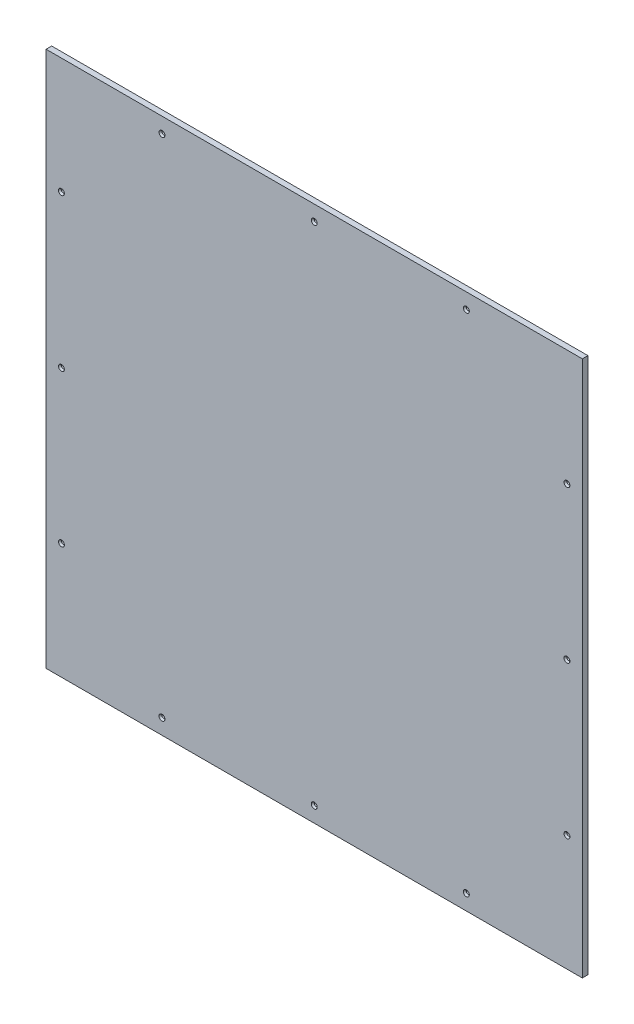
ISO-10303-21;
HEADER;
FILE_DESCRIPTION(('STEP AP214'),'2;1');
FILE_NAME('part.step','',(''),(''),'','','');
FILE_SCHEMA(('AUTOMOTIVE_DESIGN { 1 0 10303 214 1 1 1 1 }'));
ENDSEC;
DATA;
#1=APPLICATION_CONTEXT('core data for automotive mechanical design processes');
#2=APPLICATION_PROTOCOL_DEFINITION('international standard','automotive_design',2000,#1);
#3=PRODUCT_CONTEXT('',#1,'mechanical');
#4=PRODUCT('Part','Part','',(#3));
#5=PRODUCT_RELATED_PRODUCT_CATEGORY('part','',(#4));
#6=PRODUCT_DEFINITION_FORMATION('','',#4);
#7=PRODUCT_DEFINITION_CONTEXT('part definition',#1,'design');
#8=PRODUCT_DEFINITION('design','',#6,#7);
#9=PRODUCT_DEFINITION_SHAPE('','',#8);
#10=(LENGTH_UNIT() NAMED_UNIT(*) SI_UNIT(.MILLI.,.METRE.));
#11=(NAMED_UNIT(*) PLANE_ANGLE_UNIT() SI_UNIT($,.RADIAN.));
#12=(NAMED_UNIT(*) SI_UNIT($,.STERADIAN.) SOLID_ANGLE_UNIT());
#13=UNCERTAINTY_MEASURE_WITH_UNIT(LENGTH_MEASURE(1.E-05),#10,'distance_accuracy_value','');
#14=(GEOMETRIC_REPRESENTATION_CONTEXT(3) GLOBAL_UNCERTAINTY_ASSIGNED_CONTEXT((#13)) GLOBAL_UNIT_ASSIGNED_CONTEXT((#10,
#11,#12)) REPRESENTATION_CONTEXT('',''));
#15=CARTESIAN_POINT('',(0.,0.,0.));
#16=DIRECTION('',(0.,0.,1.));
#17=DIRECTION('',(1.,0.,0.));
#18=AXIS2_PLACEMENT_3D('',#15,#16,#17);
#19=CARTESIAN_POINT('',(-609.6,0.,12.7));
#20=DIRECTION('',(-1.,0.,0.));
#21=DIRECTION('',(0.,0.,1.));
#22=AXIS2_PLACEMENT_3D('',#19,#20,#21);
#23=PLANE('',#22);
#24=DIRECTION('',(0.,1.,0.));
#25=VECTOR('',#24,1.);
#26=CARTESIAN_POINT('',(-609.6,0.,0.));
#27=LINE('',#26,#25);
#28=CARTESIAN_POINT('',(-609.6,-25.4000000000001,0.));
#29=VERTEX_POINT('',#28);
#30=CARTESIAN_POINT('',(-609.6,1193.8,0.));
#31=VERTEX_POINT('',#30);
#32=EDGE_CURVE('E134',#29,#31,#27,.T.);
#33=ORIENTED_EDGE('',*,*,#32,.F.);
#34=DIRECTION('',(0.,0.,-1.));
#35=VECTOR('',#34,1.);
#36=CARTESIAN_POINT('',(-609.6,-25.4000000000001,12.7));
#37=LINE('',#36,#35);
#38=CARTESIAN_POINT('',(-609.6,-25.4000000000001,12.7));
#39=VERTEX_POINT('',#38);
#40=EDGE_CURVE('E81',#39,#29,#37,.T.);
#41=ORIENTED_EDGE('',*,*,#40,.F.);
#42=DIRECTION('',(0.,1.,0.));
#43=VECTOR('',#42,1.);
#44=CARTESIAN_POINT('',(-609.6,0.,12.7));
#45=LINE('',#44,#43);
#46=CARTESIAN_POINT('',(-609.6,1193.8,12.7));
#47=VERTEX_POINT('',#46);
#48=EDGE_CURVE('E123',#39,#47,#45,.T.);
#49=ORIENTED_EDGE('',*,*,#48,.T.);
#50=DIRECTION('',(0.,0.,-1.));
#51=VECTOR('',#50,1.);
#52=CARTESIAN_POINT('',(-609.6,1193.8,12.7));
#53=LINE('',#52,#51);
#54=EDGE_CURVE('E95',#47,#31,#53,.T.);
#55=ORIENTED_EDGE('',*,*,#54,.T.);
#56=EDGE_LOOP('',(#33,#41,#49,#55));
#57=FACE_BOUND('',#56,.T.);
#58=ADVANCED_FACE('F64',(#57),#23,.T.);
#59=CARTESIAN_POINT('',(0.,0.,0.));
#60=DIRECTION('',(0.,0.,1.));
#61=DIRECTION('',(1.,0.,0.));
#62=AXIS2_PLACEMENT_3D('',#59,#60,#61);
#63=PLANE('',#62);
#64=CARTESIAN_POINT('',(345.948,9.52500000000001,0.));
#65=DIRECTION('',(0.,0.,1.));
#66=DIRECTION('',(1.,0.,0.));
#67=AXIS2_PLACEMENT_3D('',#64,#65,#66);
#68=CIRCLE('',#67,3.57123999999998);
#69=CARTESIAN_POINT('',(349.51924,9.52500000000001,0.));
#70=VERTEX_POINT('',#69);
#71=EDGE_CURVE('E238',#70,#70,#68,.T.);
#72=ORIENTED_EDGE('',*,*,#71,.T.);
#73=EDGE_LOOP('',(#72));
#74=FACE_BOUND('',#73,.T.);
#75=CARTESIAN_POINT('',(0.127000000000099,9.52500000000001,0.));
#76=DIRECTION('',(0.,0.,1.));
#77=DIRECTION('',(1.,0.,0.));
#78=AXIS2_PLACEMENT_3D('',#75,#76,#77);
#79=CIRCLE('',#78,3.57124);
#80=CARTESIAN_POINT('',(3.6982400000001,9.52500000000001,0.));
#81=VERTEX_POINT('',#80);
#82=EDGE_CURVE('E229',#81,#81,#79,.T.);
#83=ORIENTED_EDGE('',*,*,#82,.T.);
#84=EDGE_LOOP('',(#83));
#85=FACE_BOUND('',#84,.T.);
#86=CARTESIAN_POINT('',(-346.075,9.52500000000001,0.));
#87=DIRECTION('',(0.,0.,1.));
#88=DIRECTION('',(1.,0.,0.));
#89=AXIS2_PLACEMENT_3D('',#86,#87,#88);
#90=CIRCLE('',#89,3.57123999999998);
#91=CARTESIAN_POINT('',(-342.50376,9.52500000000001,0.));
#92=VERTEX_POINT('',#91);
#93=EDGE_CURVE('E220',#92,#92,#90,.T.);
#94=ORIENTED_EDGE('',*,*,#93,.T.);
#95=EDGE_LOOP('',(#94));
#96=FACE_BOUND('',#95,.T.);
#97=CARTESIAN_POINT('',(-574.675,238.252,0.));
#98=DIRECTION('',(0.,0.,1.));
#99=DIRECTION('',(1.,0.,0.));
#100=AXIS2_PLACEMENT_3D('',#97,#98,#99);
#101=CIRCLE('',#100,3.57123999999998);
#102=CARTESIAN_POINT('',(-571.10376,238.252,0.));
#103=VERTEX_POINT('',#102);
#104=EDGE_CURVE('E211',#103,#103,#101,.T.);
#105=ORIENTED_EDGE('',*,*,#104,.T.);
#106=EDGE_LOOP('',(#105));
#107=FACE_BOUND('',#106,.T.);
#108=CARTESIAN_POINT('',(-574.675,583.946,0.));
#109=DIRECTION('',(0.,0.,1.));
#110=DIRECTION('',(1.,0.,0.));
#111=AXIS2_PLACEMENT_3D('',#108,#109,#110);
#112=CIRCLE('',#111,3.57123999999998);
#113=CARTESIAN_POINT('',(-571.10376,583.946,0.));
#114=VERTEX_POINT('',#113);
#115=EDGE_CURVE('E202',#114,#114,#112,.T.);
#116=ORIENTED_EDGE('',*,*,#115,.T.);
#117=EDGE_LOOP('',(#116));
#118=FACE_BOUND('',#117,.T.);
#119=CARTESIAN_POINT('',(-574.675,930.148,0.));
#120=DIRECTION('',(0.,0.,1.));
#121=DIRECTION('',(1.,0.,0.));
#122=AXIS2_PLACEMENT_3D('',#119,#120,#121);
#123=CIRCLE('',#122,3.57123999999998);
#124=CARTESIAN_POINT('',(-571.10376,930.148,0.));
#125=VERTEX_POINT('',#124);
#126=EDGE_CURVE('E193',#125,#125,#123,.T.);
#127=ORIENTED_EDGE('',*,*,#126,.T.);
#128=EDGE_LOOP('',(#127));
#129=FACE_BOUND('',#128,.T.);
#130=CARTESIAN_POINT('',(-346.075,1158.875,0.));
#131=DIRECTION('',(0.,0.,1.));
#132=DIRECTION('',(1.,0.,0.));
#133=AXIS2_PLACEMENT_3D('',#130,#131,#132);
#134=CIRCLE('',#133,3.57123999999998);
#135=CARTESIAN_POINT('',(-342.50376,1158.875,0.));
#136=VERTEX_POINT('',#135);
#137=EDGE_CURVE('E184',#136,#136,#134,.T.);
#138=ORIENTED_EDGE('',*,*,#137,.T.);
#139=EDGE_LOOP('',(#138));
#140=FACE_BOUND('',#139,.T.);
#141=CARTESIAN_POINT('',(0.127000000000099,1158.875,0.));
#142=DIRECTION('',(0.,0.,1.));
#143=DIRECTION('',(1.,0.,0.));
#144=AXIS2_PLACEMENT_3D('',#141,#142,#143);
#145=CIRCLE('',#144,3.57124);
#146=CARTESIAN_POINT('',(3.6982400000001,1158.875,0.));
#147=VERTEX_POINT('',#146);
#148=EDGE_CURVE('E175',#147,#147,#145,.T.);
#149=ORIENTED_EDGE('',*,*,#148,.T.);
#150=EDGE_LOOP('',(#149));
#151=FACE_BOUND('',#150,.T.);
#152=CARTESIAN_POINT('',(345.948,1158.875,0.));
#153=DIRECTION('',(0.,0.,1.));
#154=DIRECTION('',(1.,0.,0.));
#155=AXIS2_PLACEMENT_3D('',#152,#153,#154);
#156=CIRCLE('',#155,3.57123999999998);
#157=CARTESIAN_POINT('',(349.51924,1158.875,0.));
#158=VERTEX_POINT('',#157);
#159=EDGE_CURVE('E166',#158,#158,#156,.T.);
#160=ORIENTED_EDGE('',*,*,#159,.T.);
#161=EDGE_LOOP('',(#160));
#162=FACE_BOUND('',#161,.T.);
#163=CARTESIAN_POINT('',(574.675,930.148,0.));
#164=DIRECTION('',(0.,0.,1.));
#165=DIRECTION('',(1.,0.,0.));
#166=AXIS2_PLACEMENT_3D('',#163,#164,#165);
#167=CIRCLE('',#166,3.57123999999998);
#168=CARTESIAN_POINT('',(578.24624,930.148,0.));
#169=VERTEX_POINT('',#168);
#170=EDGE_CURVE('E157',#169,#169,#167,.T.);
#171=ORIENTED_EDGE('',*,*,#170,.T.);
#172=EDGE_LOOP('',(#171));
#173=FACE_BOUND('',#172,.T.);
#174=CARTESIAN_POINT('',(574.675,583.946,0.));
#175=DIRECTION('',(0.,0.,1.));
#176=DIRECTION('',(1.,0.,0.));
#177=AXIS2_PLACEMENT_3D('',#174,#175,#176);
#178=CIRCLE('',#177,3.57123999999998);
#179=CARTESIAN_POINT('',(578.24624,583.946,0.));
#180=VERTEX_POINT('',#179);
#181=EDGE_CURVE('E148',#180,#180,#178,.T.);
#182=ORIENTED_EDGE('',*,*,#181,.T.);
#183=EDGE_LOOP('',(#182));
#184=FACE_BOUND('',#183,.T.);
#185=CARTESIAN_POINT('',(574.675,238.252,0.));
#186=DIRECTION('',(0.,0.,1.));
#187=DIRECTION('',(1.,0.,0.));
#188=AXIS2_PLACEMENT_3D('',#185,#186,#187);
#189=CIRCLE('',#188,3.57123999999998);
#190=CARTESIAN_POINT('',(578.24624,238.252,0.));
#191=VERTEX_POINT('',#190);
#192=EDGE_CURVE('E130',#191,#191,#189,.T.);
#193=ORIENTED_EDGE('',*,*,#192,.T.);
#194=EDGE_LOOP('',(#193));
#195=FACE_BOUND('',#194,.T.);
#196=DIRECTION('',(1.,0.,0.));
#197=VECTOR('',#196,1.);
#198=CARTESIAN_POINT('',(0.,-25.4000000000001,0.));
#199=LINE('',#198,#197);
#200=CARTESIAN_POINT('',(609.6,-25.4000000000001,0.));
#201=VERTEX_POINT('',#200);
#202=EDGE_CURVE('E128',#29,#201,#199,.T.);
#203=ORIENTED_EDGE('',*,*,#202,.F.);
#204=ORIENTED_EDGE('',*,*,#32,.T.);
#205=DIRECTION('',(1.,0.,0.));
#206=VECTOR('',#205,1.);
#207=CARTESIAN_POINT('',(0.,1193.8,0.));
#208=LINE('',#207,#206);
#209=CARTESIAN_POINT('',(609.6,1193.8,0.));
#210=VERTEX_POINT('',#209);
#211=EDGE_CURVE('E132',#31,#210,#208,.T.);
#212=ORIENTED_EDGE('',*,*,#211,.T.);
#213=DIRECTION('',(0.,1.,0.));
#214=VECTOR('',#213,1.);
#215=CARTESIAN_POINT('',(609.6,0.,0.));
#216=LINE('',#215,#214);
#217=EDGE_CURVE('E119',#201,#210,#216,.T.);
#218=ORIENTED_EDGE('',*,*,#217,.F.);
#219=EDGE_LOOP('',(#203,#204,#212,#218));
#220=FACE_BOUND('',#219,.T.);
#221=ADVANCED_FACE('F291',(#74,#85,#96,#107,#118,#129,#140,#151,#162,#173,#184,#195,#220),#63,.F.);
#222=CARTESIAN_POINT('',(0.,1193.8,12.7));
#223=DIRECTION('',(0.,1.,0.));
#224=DIRECTION('',(0.,0.,1.));
#225=AXIS2_PLACEMENT_3D('',#222,#223,#224);
#226=PLANE('',#225);
#227=ORIENTED_EDGE('',*,*,#211,.F.);
#228=ORIENTED_EDGE('',*,*,#54,.F.);
#229=DIRECTION('',(1.,0.,0.));
#230=VECTOR('',#229,1.);
#231=CARTESIAN_POINT('',(0.,1193.8,12.7));
#232=LINE('',#231,#230);
#233=CARTESIAN_POINT('',(609.6,1193.8,12.7));
#234=VERTEX_POINT('',#233);
#235=EDGE_CURVE('E113',#47,#234,#232,.T.);
#236=ORIENTED_EDGE('',*,*,#235,.T.);
#237=DIRECTION('',(0.,0.,-1.));
#238=VECTOR('',#237,1.);
#239=CARTESIAN_POINT('',(609.6,1193.8,12.7));
#240=LINE('',#239,#238);
#241=EDGE_CURVE('E73',#234,#210,#240,.T.);
#242=ORIENTED_EDGE('',*,*,#241,.T.);
#243=EDGE_LOOP('',(#227,#228,#236,#242));
#244=FACE_BOUND('',#243,.T.);
#245=ADVANCED_FACE('F122',(#244),#226,.T.);
#246=CARTESIAN_POINT('',(609.6,0.,12.7));
#247=DIRECTION('',(-1.,0.,0.));
#248=DIRECTION('',(0.,0.,1.));
#249=AXIS2_PLACEMENT_3D('',#246,#247,#248);
#250=PLANE('',#249);
#251=ORIENTED_EDGE('',*,*,#217,.T.);
#252=ORIENTED_EDGE('',*,*,#241,.F.);
#253=DIRECTION('',(0.,1.,0.));
#254=VECTOR('',#253,1.);
#255=CARTESIAN_POINT('',(609.6,0.,12.7));
#256=LINE('',#255,#254);
#257=CARTESIAN_POINT('',(609.6,-25.4000000000001,12.7));
#258=VERTEX_POINT('',#257);
#259=EDGE_CURVE('E106',#258,#234,#256,.T.);
#260=ORIENTED_EDGE('',*,*,#259,.F.);
#261=DIRECTION('',(0.,0.,-1.));
#262=VECTOR('',#261,1.);
#263=CARTESIAN_POINT('',(609.6,-25.4000000000001,12.7));
#264=LINE('',#263,#262);
#265=EDGE_CURVE('E12',#258,#201,#264,.T.);
#266=ORIENTED_EDGE('',*,*,#265,.T.);
#267=EDGE_LOOP('',(#251,#252,#260,#266));
#268=FACE_BOUND('',#267,.T.);
#269=ADVANCED_FACE('F118',(#268),#250,.F.);
#270=CARTESIAN_POINT('',(0.,-25.4000000000001,12.7));
#271=DIRECTION('',(0.,1.,0.));
#272=DIRECTION('',(0.,0.,1.));
#273=AXIS2_PLACEMENT_3D('',#270,#271,#272);
#274=PLANE('',#273);
#275=ORIENTED_EDGE('',*,*,#202,.T.);
#276=ORIENTED_EDGE('',*,*,#265,.F.);
#277=DIRECTION('',(1.,0.,0.));
#278=VECTOR('',#277,1.);
#279=CARTESIAN_POINT('',(0.,-25.4000000000001,12.7));
#280=LINE('',#279,#278);
#281=EDGE_CURVE('E114',#39,#258,#280,.T.);
#282=ORIENTED_EDGE('',*,*,#281,.F.);
#283=ORIENTED_EDGE('',*,*,#40,.T.);
#284=EDGE_LOOP('',(#275,#276,#282,#283));
#285=FACE_BOUND('',#284,.T.);
#286=ADVANCED_FACE('F66',(#285),#274,.F.);
#287=CARTESIAN_POINT('',(0.,0.,12.7));
#288=DIRECTION('',(0.,0.,1.));
#289=DIRECTION('',(1.,0.,0.));
#290=AXIS2_PLACEMENT_3D('',#287,#288,#289);
#291=PLANE('',#290);
#292=CARTESIAN_POINT('',(345.948,9.52500000000001,12.7));
#293=DIRECTION('',(0.,0.,1.));
#294=DIRECTION('',(1.,0.,0.));
#295=AXIS2_PLACEMENT_3D('',#292,#293,#294);
#296=CIRCLE('',#295,6.74370000000002);
#297=CARTESIAN_POINT('',(352.6917,9.52500000000001,12.7));
#298=VERTEX_POINT('',#297);
#299=EDGE_CURVE('E244',#298,#298,#296,.T.);
#300=ORIENTED_EDGE('',*,*,#299,.F.);
#301=EDGE_LOOP('',(#300));
#302=FACE_BOUND('',#301,.T.);
#303=CARTESIAN_POINT('',(0.127000000000099,9.52500000000001,12.7));
#304=DIRECTION('',(0.,0.,1.));
#305=DIRECTION('',(1.,0.,0.));
#306=AXIS2_PLACEMENT_3D('',#303,#304,#305);
#307=CIRCLE('',#306,6.7437);
#308=CARTESIAN_POINT('',(6.8707000000001,9.52500000000001,12.7));
#309=VERTEX_POINT('',#308);
#310=EDGE_CURVE('E235',#309,#309,#307,.T.);
#311=ORIENTED_EDGE('',*,*,#310,.F.);
#312=EDGE_LOOP('',(#311));
#313=FACE_BOUND('',#312,.T.);
#314=CARTESIAN_POINT('',(-346.075,9.52500000000001,12.7));
#315=DIRECTION('',(0.,0.,1.));
#316=DIRECTION('',(1.,0.,0.));
#317=AXIS2_PLACEMENT_3D('',#314,#315,#316);
#318=CIRCLE('',#317,6.74370000000002);
#319=CARTESIAN_POINT('',(-339.3313,9.52500000000001,12.7));
#320=VERTEX_POINT('',#319);
#321=EDGE_CURVE('E226',#320,#320,#318,.T.);
#322=ORIENTED_EDGE('',*,*,#321,.F.);
#323=EDGE_LOOP('',(#322));
#324=FACE_BOUND('',#323,.T.);
#325=CARTESIAN_POINT('',(-574.675,238.252,12.7));
#326=DIRECTION('',(0.,0.,1.));
#327=DIRECTION('',(1.,0.,0.));
#328=AXIS2_PLACEMENT_3D('',#325,#326,#327);
#329=CIRCLE('',#328,6.74370000000002);
#330=CARTESIAN_POINT('',(-567.9313,238.252,12.7));
#331=VERTEX_POINT('',#330);
#332=EDGE_CURVE('E217',#331,#331,#329,.T.);
#333=ORIENTED_EDGE('',*,*,#332,.F.);
#334=EDGE_LOOP('',(#333));
#335=FACE_BOUND('',#334,.T.);
#336=CARTESIAN_POINT('',(-574.675,583.946,12.7));
#337=DIRECTION('',(0.,0.,1.));
#338=DIRECTION('',(1.,0.,0.));
#339=AXIS2_PLACEMENT_3D('',#336,#337,#338);
#340=CIRCLE('',#339,6.74370000000002);
#341=CARTESIAN_POINT('',(-567.9313,583.946,12.7));
#342=VERTEX_POINT('',#341);
#343=EDGE_CURVE('E208',#342,#342,#340,.T.);
#344=ORIENTED_EDGE('',*,*,#343,.F.);
#345=EDGE_LOOP('',(#344));
#346=FACE_BOUND('',#345,.T.);
#347=CARTESIAN_POINT('',(-574.675,930.148,12.7));
#348=DIRECTION('',(0.,0.,1.));
#349=DIRECTION('',(1.,0.,0.));
#350=AXIS2_PLACEMENT_3D('',#347,#348,#349);
#351=CIRCLE('',#350,6.74370000000002);
#352=CARTESIAN_POINT('',(-567.9313,930.148,12.7));
#353=VERTEX_POINT('',#352);
#354=EDGE_CURVE('E199',#353,#353,#351,.T.);
#355=ORIENTED_EDGE('',*,*,#354,.F.);
#356=EDGE_LOOP('',(#355));
#357=FACE_BOUND('',#356,.T.);
#358=CARTESIAN_POINT('',(-346.075,1158.875,12.7));
#359=DIRECTION('',(0.,0.,1.));
#360=DIRECTION('',(1.,0.,0.));
#361=AXIS2_PLACEMENT_3D('',#358,#359,#360);
#362=CIRCLE('',#361,6.74370000000002);
#363=CARTESIAN_POINT('',(-339.3313,1158.875,12.7));
#364=VERTEX_POINT('',#363);
#365=EDGE_CURVE('E190',#364,#364,#362,.T.);
#366=ORIENTED_EDGE('',*,*,#365,.F.);
#367=EDGE_LOOP('',(#366));
#368=FACE_BOUND('',#367,.T.);
#369=CARTESIAN_POINT('',(0.127000000000099,1158.875,12.7));
#370=DIRECTION('',(0.,0.,1.));
#371=DIRECTION('',(1.,0.,0.));
#372=AXIS2_PLACEMENT_3D('',#369,#370,#371);
#373=CIRCLE('',#372,6.7437);
#374=CARTESIAN_POINT('',(6.8707000000001,1158.875,12.7));
#375=VERTEX_POINT('',#374);
#376=EDGE_CURVE('E181',#375,#375,#373,.T.);
#377=ORIENTED_EDGE('',*,*,#376,.F.);
#378=EDGE_LOOP('',(#377));
#379=FACE_BOUND('',#378,.T.);
#380=CARTESIAN_POINT('',(345.948,1158.875,12.7));
#381=DIRECTION('',(0.,0.,1.));
#382=DIRECTION('',(1.,0.,0.));
#383=AXIS2_PLACEMENT_3D('',#380,#381,#382);
#384=CIRCLE('',#383,6.74370000000002);
#385=CARTESIAN_POINT('',(352.6917,1158.875,12.7));
#386=VERTEX_POINT('',#385);
#387=EDGE_CURVE('E172',#386,#386,#384,.T.);
#388=ORIENTED_EDGE('',*,*,#387,.F.);
#389=EDGE_LOOP('',(#388));
#390=FACE_BOUND('',#389,.T.);
#391=CARTESIAN_POINT('',(574.675,930.148,12.7));
#392=DIRECTION('',(0.,0.,1.));
#393=DIRECTION('',(1.,0.,0.));
#394=AXIS2_PLACEMENT_3D('',#391,#392,#393);
#395=CIRCLE('',#394,6.74370000000002);
#396=CARTESIAN_POINT('',(581.4187,930.148,12.7));
#397=VERTEX_POINT('',#396);
#398=EDGE_CURVE('E163',#397,#397,#395,.T.);
#399=ORIENTED_EDGE('',*,*,#398,.F.);
#400=EDGE_LOOP('',(#399));
#401=FACE_BOUND('',#400,.T.);
#402=CARTESIAN_POINT('',(574.675,583.946,12.7));
#403=DIRECTION('',(0.,0.,1.));
#404=DIRECTION('',(1.,0.,0.));
#405=AXIS2_PLACEMENT_3D('',#402,#403,#404);
#406=CIRCLE('',#405,6.74370000000002);
#407=CARTESIAN_POINT('',(581.4187,583.946,12.7));
#408=VERTEX_POINT('',#407);
#409=EDGE_CURVE('E154',#408,#408,#406,.T.);
#410=ORIENTED_EDGE('',*,*,#409,.F.);
#411=EDGE_LOOP('',(#410));
#412=FACE_BOUND('',#411,.T.);
#413=CARTESIAN_POINT('',(574.675,238.252,12.7));
#414=DIRECTION('',(0.,0.,1.));
#415=DIRECTION('',(1.,0.,0.));
#416=AXIS2_PLACEMENT_3D('',#413,#414,#415);
#417=CIRCLE('',#416,6.74370000000002);
#418=CARTESIAN_POINT('',(581.4187,238.252,12.7));
#419=VERTEX_POINT('',#418);
#420=EDGE_CURVE('E145',#419,#419,#417,.T.);
#421=ORIENTED_EDGE('',*,*,#420,.F.);
#422=EDGE_LOOP('',(#421));
#423=FACE_BOUND('',#422,.T.);
#424=ORIENTED_EDGE('',*,*,#281,.T.);
#425=ORIENTED_EDGE('',*,*,#259,.T.);
#426=ORIENTED_EDGE('',*,*,#235,.F.);
#427=ORIENTED_EDGE('',*,*,#48,.F.);
#428=EDGE_LOOP('',(#424,#425,#426,#427));
#429=FACE_BOUND('',#428,.T.);
#430=ADVANCED_FACE('F110',(#302,#313,#324,#335,#346,#357,#368,#379,#390,#401,#412,#423,#429),
#291,.T.);
#431=CARTESIAN_POINT('',(574.675,238.252,12.7));
#432=DIRECTION('',(0.,0.,1.));
#433=DIRECTION('',(1.,0.,0.));
#434=AXIS2_PLACEMENT_3D('',#431,#432,#433);
#435=CYLINDRICAL_SURFACE('',#434,3.57123999999998);
#436=ORIENTED_EDGE('',*,*,#192,.F.);
#437=EDGE_LOOP('',(#436));
#438=FACE_BOUND('',#437,.T.);
#439=CARTESIAN_POINT('',(574.675,238.252,9.05050224282764));
#440=DIRECTION('',(0.,0.,1.));
#441=DIRECTION('',(1.,0.,0.));
#442=AXIS2_PLACEMENT_3D('',#439,#440,#441);
#443=CIRCLE('',#442,3.57123999999998);
#444=CARTESIAN_POINT('',(578.24624,238.252,9.05050224282764));
#445=VERTEX_POINT('',#444);
#446=EDGE_CURVE('E142',#445,#445,#443,.T.);
#447=ORIENTED_EDGE('',*,*,#446,.T.);
#448=EDGE_LOOP('',(#447));
#449=FACE_BOUND('',#448,.T.);
#450=ADVANCED_FACE('F252',(#438,#449),#435,.F.);
#451=CARTESIAN_POINT('',(574.675,238.252,12.7));
#452=DIRECTION('',(0.,0.,1.));
#453=DIRECTION('',(1.,0.,0.));
#454=AXIS2_PLACEMENT_3D('',#451,#452,#453);
#455=CONICAL_SURFACE('',#454,6.74370000000002,0.715584993317682);
#456=ORIENTED_EDGE('',*,*,#446,.F.);
#457=EDGE_LOOP('',(#456));
#458=FACE_BOUND('',#457,.T.);
#459=ORIENTED_EDGE('',*,*,#420,.T.);
#460=EDGE_LOOP('',(#459));
#461=FACE_BOUND('',#460,.T.);
#462=ADVANCED_FACE('F276',(#458,#461),#455,.F.);
#463=CARTESIAN_POINT('',(574.675,583.946,12.7));
#464=DIRECTION('',(0.,0.,1.));
#465=DIRECTION('',(1.,0.,0.));
#466=AXIS2_PLACEMENT_3D('',#463,#464,#465);
#467=CYLINDRICAL_SURFACE('',#466,3.57123999999998);
#468=ORIENTED_EDGE('',*,*,#181,.F.);
#469=EDGE_LOOP('',(#468));
#470=FACE_BOUND('',#469,.T.);
#471=CARTESIAN_POINT('',(574.675,583.946,9.05050224282764));
#472=DIRECTION('',(0.,0.,1.));
#473=DIRECTION('',(1.,0.,0.));
#474=AXIS2_PLACEMENT_3D('',#471,#472,#473);
#475=CIRCLE('',#474,3.57123999999998);
#476=CARTESIAN_POINT('',(578.24624,583.946,9.05050224282764));
#477=VERTEX_POINT('',#476);
#478=EDGE_CURVE('E151',#477,#477,#475,.T.);
#479=ORIENTED_EDGE('',*,*,#478,.T.);
#480=EDGE_LOOP('',(#479));
#481=FACE_BOUND('',#480,.T.);
#482=ADVANCED_FACE('F278',(#470,#481),#467,.F.);
#483=CARTESIAN_POINT('',(574.675,583.946,12.7));
#484=DIRECTION('',(0.,0.,1.));
#485=DIRECTION('',(1.,0.,0.));
#486=AXIS2_PLACEMENT_3D('',#483,#484,#485);
#487=CONICAL_SURFACE('',#486,6.74370000000002,0.715584993317682);
#488=ORIENTED_EDGE('',*,*,#478,.F.);
#489=EDGE_LOOP('',(#488));
#490=FACE_BOUND('',#489,.T.);
#491=ORIENTED_EDGE('',*,*,#409,.T.);
#492=EDGE_LOOP('',(#491));
#493=FACE_BOUND('',#492,.T.);
#494=ADVANCED_FACE('F285',(#490,#493),#487,.F.);
#495=CARTESIAN_POINT('',(574.675,930.148,12.7));
#496=DIRECTION('',(0.,0.,1.));
#497=DIRECTION('',(1.,0.,0.));
#498=AXIS2_PLACEMENT_3D('',#495,#496,#497);
#499=CYLINDRICAL_SURFACE('',#498,3.57123999999998);
#500=ORIENTED_EDGE('',*,*,#170,.F.);
#501=EDGE_LOOP('',(#500));
#502=FACE_BOUND('',#501,.T.);
#503=CARTESIAN_POINT('',(574.675,930.148,9.05050224282764));
#504=DIRECTION('',(0.,0.,1.));
#505=DIRECTION('',(1.,0.,0.));
#506=AXIS2_PLACEMENT_3D('',#503,#504,#505);
#507=CIRCLE('',#506,3.57123999999998);
#508=CARTESIAN_POINT('',(578.24624,930.148,9.05050224282764));
#509=VERTEX_POINT('',#508);
#510=EDGE_CURVE('E160',#509,#509,#507,.T.);
#511=ORIENTED_EDGE('',*,*,#510,.T.);
#512=EDGE_LOOP('',(#511));
#513=FACE_BOUND('',#512,.T.);
#514=ADVANCED_FACE('F338',(#502,#513),#499,.F.);
#515=CARTESIAN_POINT('',(574.675,930.148,12.7));
#516=DIRECTION('',(0.,0.,1.));
#517=DIRECTION('',(1.,0.,0.));
#518=AXIS2_PLACEMENT_3D('',#515,#516,#517);
#519=CONICAL_SURFACE('',#518,6.74370000000002,0.715584993317682);
#520=ORIENTED_EDGE('',*,*,#510,.F.);
#521=EDGE_LOOP('',(#520));
#522=FACE_BOUND('',#521,.T.);
#523=ORIENTED_EDGE('',*,*,#398,.T.);
#524=EDGE_LOOP('',(#523));
#525=FACE_BOUND('',#524,.T.);
#526=ADVANCED_FACE('F348',(#522,#525),#519,.F.);
#527=CARTESIAN_POINT('',(345.948,1158.875,12.7));
#528=DIRECTION('',(0.,0.,1.));
#529=DIRECTION('',(1.,0.,0.));
#530=AXIS2_PLACEMENT_3D('',#527,#528,#529);
#531=CYLINDRICAL_SURFACE('',#530,3.57123999999998);
#532=ORIENTED_EDGE('',*,*,#159,.F.);
#533=EDGE_LOOP('',(#532));
#534=FACE_BOUND('',#533,.T.);
#535=CARTESIAN_POINT('',(345.948,1158.875,9.05050224282764));
#536=DIRECTION('',(0.,0.,1.));
#537=DIRECTION('',(1.,0.,0.));
#538=AXIS2_PLACEMENT_3D('',#535,#536,#537);
#539=CIRCLE('',#538,3.57123999999998);
#540=CARTESIAN_POINT('',(349.51924,1158.875,9.05050224282764));
#541=VERTEX_POINT('',#540);
#542=EDGE_CURVE('E169',#541,#541,#539,.T.);
#543=ORIENTED_EDGE('',*,*,#542,.T.);
#544=EDGE_LOOP('',(#543));
#545=FACE_BOUND('',#544,.T.);
#546=ADVANCED_FACE('F358',(#534,#545),#531,.F.);
#547=CARTESIAN_POINT('',(345.948,1158.875,12.7));
#548=DIRECTION('',(0.,0.,1.));
#549=DIRECTION('',(1.,0.,0.));
#550=AXIS2_PLACEMENT_3D('',#547,#548,#549);
#551=CONICAL_SURFACE('',#550,6.74370000000002,0.715584993317682);
#552=ORIENTED_EDGE('',*,*,#542,.F.);
#553=EDGE_LOOP('',(#552));
#554=FACE_BOUND('',#553,.T.);
#555=ORIENTED_EDGE('',*,*,#387,.T.);
#556=EDGE_LOOP('',(#555));
#557=FACE_BOUND('',#556,.T.);
#558=ADVANCED_FACE('F368',(#554,#557),#551,.F.);
#559=CARTESIAN_POINT('',(0.127000000000099,1158.875,12.7));
#560=DIRECTION('',(0.,0.,1.));
#561=DIRECTION('',(1.,0.,0.));
#562=AXIS2_PLACEMENT_3D('',#559,#560,#561);
#563=CYLINDRICAL_SURFACE('',#562,3.57124);
#564=ORIENTED_EDGE('',*,*,#148,.F.);
#565=EDGE_LOOP('',(#564));
#566=FACE_BOUND('',#565,.T.);
#567=CARTESIAN_POINT('',(0.127000000000099,1158.875,9.05050224282764));
#568=DIRECTION('',(0.,0.,1.));
#569=DIRECTION('',(1.,0.,0.));
#570=AXIS2_PLACEMENT_3D('',#567,#568,#569);
#571=CIRCLE('',#570,3.57124);
#572=CARTESIAN_POINT('',(3.6982400000001,1158.875,9.05050224282764));
#573=VERTEX_POINT('',#572);
#574=EDGE_CURVE('E178',#573,#573,#571,.T.);
#575=ORIENTED_EDGE('',*,*,#574,.T.);
#576=EDGE_LOOP('',(#575));
#577=FACE_BOUND('',#576,.T.);
#578=ADVANCED_FACE('F378',(#566,#577),#563,.F.);
#579=CARTESIAN_POINT('',(0.127000000000099,1158.875,12.7));
#580=DIRECTION('',(0.,0.,1.));
#581=DIRECTION('',(1.,0.,0.));
#582=AXIS2_PLACEMENT_3D('',#579,#580,#581);
#583=CONICAL_SURFACE('',#582,6.7437,0.715584993317676);
#584=ORIENTED_EDGE('',*,*,#574,.F.);
#585=EDGE_LOOP('',(#584));
#586=FACE_BOUND('',#585,.T.);
#587=ORIENTED_EDGE('',*,*,#376,.T.);
#588=EDGE_LOOP('',(#587));
#589=FACE_BOUND('',#588,.T.);
#590=ADVANCED_FACE('F388',(#586,#589),#583,.F.);
#591=CARTESIAN_POINT('',(-346.075,1158.875,12.7));
#592=DIRECTION('',(0.,0.,1.));
#593=DIRECTION('',(1.,0.,0.));
#594=AXIS2_PLACEMENT_3D('',#591,#592,#593);
#595=CYLINDRICAL_SURFACE('',#594,3.57123999999998);
#596=ORIENTED_EDGE('',*,*,#137,.F.);
#597=EDGE_LOOP('',(#596));
#598=FACE_BOUND('',#597,.T.);
#599=CARTESIAN_POINT('',(-346.075,1158.875,9.05050224282764));
#600=DIRECTION('',(0.,0.,1.));
#601=DIRECTION('',(1.,0.,0.));
#602=AXIS2_PLACEMENT_3D('',#599,#600,#601);
#603=CIRCLE('',#602,3.57123999999998);
#604=CARTESIAN_POINT('',(-342.50376,1158.875,9.05050224282764));
#605=VERTEX_POINT('',#604);
#606=EDGE_CURVE('E187',#605,#605,#603,.T.);
#607=ORIENTED_EDGE('',*,*,#606,.T.);
#608=EDGE_LOOP('',(#607));
#609=FACE_BOUND('',#608,.T.);
#610=ADVANCED_FACE('F398',(#598,#609),#595,.F.);
#611=CARTESIAN_POINT('',(-346.075,1158.875,12.7));
#612=DIRECTION('',(0.,0.,1.));
#613=DIRECTION('',(1.,0.,0.));
#614=AXIS2_PLACEMENT_3D('',#611,#612,#613);
#615=CONICAL_SURFACE('',#614,6.74370000000002,0.715584993317682);
#616=ORIENTED_EDGE('',*,*,#606,.F.);
#617=EDGE_LOOP('',(#616));
#618=FACE_BOUND('',#617,.T.);
#619=ORIENTED_EDGE('',*,*,#365,.T.);
#620=EDGE_LOOP('',(#619));
#621=FACE_BOUND('',#620,.T.);
#622=ADVANCED_FACE('F408',(#618,#621),#615,.F.);
#623=CARTESIAN_POINT('',(-574.675,930.148,12.7));
#624=DIRECTION('',(0.,0.,1.));
#625=DIRECTION('',(1.,0.,0.));
#626=AXIS2_PLACEMENT_3D('',#623,#624,#625);
#627=CYLINDRICAL_SURFACE('',#626,3.57123999999998);
#628=ORIENTED_EDGE('',*,*,#126,.F.);
#629=EDGE_LOOP('',(#628));
#630=FACE_BOUND('',#629,.T.);
#631=CARTESIAN_POINT('',(-574.675,930.148,9.05050224282764));
#632=DIRECTION('',(0.,0.,1.));
#633=DIRECTION('',(1.,0.,0.));
#634=AXIS2_PLACEMENT_3D('',#631,#632,#633);
#635=CIRCLE('',#634,3.57123999999998);
#636=CARTESIAN_POINT('',(-571.10376,930.148,9.05050224282764));
#637=VERTEX_POINT('',#636);
#638=EDGE_CURVE('E196',#637,#637,#635,.T.);
#639=ORIENTED_EDGE('',*,*,#638,.T.);
#640=EDGE_LOOP('',(#639));
#641=FACE_BOUND('',#640,.T.);
#642=ADVANCED_FACE('F418',(#630,#641),#627,.F.);
#643=CARTESIAN_POINT('',(-574.675,930.148,12.7));
#644=DIRECTION('',(0.,0.,1.));
#645=DIRECTION('',(1.,0.,0.));
#646=AXIS2_PLACEMENT_3D('',#643,#644,#645);
#647=CONICAL_SURFACE('',#646,6.74370000000002,0.715584993317682);
#648=ORIENTED_EDGE('',*,*,#638,.F.);
#649=EDGE_LOOP('',(#648));
#650=FACE_BOUND('',#649,.T.);
#651=ORIENTED_EDGE('',*,*,#354,.T.);
#652=EDGE_LOOP('',(#651));
#653=FACE_BOUND('',#652,.T.);
#654=ADVANCED_FACE('F428',(#650,#653),#647,.F.);
#655=CARTESIAN_POINT('',(-574.675,583.946,12.7));
#656=DIRECTION('',(0.,0.,1.));
#657=DIRECTION('',(1.,0.,0.));
#658=AXIS2_PLACEMENT_3D('',#655,#656,#657);
#659=CYLINDRICAL_SURFACE('',#658,3.57123999999998);
#660=ORIENTED_EDGE('',*,*,#115,.F.);
#661=EDGE_LOOP('',(#660));
#662=FACE_BOUND('',#661,.T.);
#663=CARTESIAN_POINT('',(-574.675,583.946,9.05050224282764));
#664=DIRECTION('',(0.,0.,1.));
#665=DIRECTION('',(1.,0.,0.));
#666=AXIS2_PLACEMENT_3D('',#663,#664,#665);
#667=CIRCLE('',#666,3.57123999999998);
#668=CARTESIAN_POINT('',(-571.10376,583.946,9.05050224282764));
#669=VERTEX_POINT('',#668);
#670=EDGE_CURVE('E205',#669,#669,#667,.T.);
#671=ORIENTED_EDGE('',*,*,#670,.T.);
#672=EDGE_LOOP('',(#671));
#673=FACE_BOUND('',#672,.T.);
#674=ADVANCED_FACE('F438',(#662,#673),#659,.F.);
#675=CARTESIAN_POINT('',(-574.675,583.946,12.7));
#676=DIRECTION('',(0.,0.,1.));
#677=DIRECTION('',(1.,0.,0.));
#678=AXIS2_PLACEMENT_3D('',#675,#676,#677);
#679=CONICAL_SURFACE('',#678,6.74370000000002,0.715584993317682);
#680=ORIENTED_EDGE('',*,*,#670,.F.);
#681=EDGE_LOOP('',(#680));
#682=FACE_BOUND('',#681,.T.);
#683=ORIENTED_EDGE('',*,*,#343,.T.);
#684=EDGE_LOOP('',(#683));
#685=FACE_BOUND('',#684,.T.);
#686=ADVANCED_FACE('F448',(#682,#685),#679,.F.);
#687=CARTESIAN_POINT('',(-574.675,238.252,12.7));
#688=DIRECTION('',(0.,0.,1.));
#689=DIRECTION('',(1.,0.,0.));
#690=AXIS2_PLACEMENT_3D('',#687,#688,#689);
#691=CYLINDRICAL_SURFACE('',#690,3.57123999999998);
#692=ORIENTED_EDGE('',*,*,#104,.F.);
#693=EDGE_LOOP('',(#692));
#694=FACE_BOUND('',#693,.T.);
#695=CARTESIAN_POINT('',(-574.675,238.252,9.05050224282764));
#696=DIRECTION('',(0.,0.,1.));
#697=DIRECTION('',(1.,0.,0.));
#698=AXIS2_PLACEMENT_3D('',#695,#696,#697);
#699=CIRCLE('',#698,3.57123999999998);
#700=CARTESIAN_POINT('',(-571.10376,238.252,9.05050224282764));
#701=VERTEX_POINT('',#700);
#702=EDGE_CURVE('E214',#701,#701,#699,.T.);
#703=ORIENTED_EDGE('',*,*,#702,.T.);
#704=EDGE_LOOP('',(#703));
#705=FACE_BOUND('',#704,.T.);
#706=ADVANCED_FACE('F458',(#694,#705),#691,.F.);
#707=CARTESIAN_POINT('',(-574.675,238.252,12.7));
#708=DIRECTION('',(0.,0.,1.));
#709=DIRECTION('',(1.,0.,0.));
#710=AXIS2_PLACEMENT_3D('',#707,#708,#709);
#711=CONICAL_SURFACE('',#710,6.74370000000002,0.715584993317682);
#712=ORIENTED_EDGE('',*,*,#702,.F.);
#713=EDGE_LOOP('',(#712));
#714=FACE_BOUND('',#713,.T.);
#715=ORIENTED_EDGE('',*,*,#332,.T.);
#716=EDGE_LOOP('',(#715));
#717=FACE_BOUND('',#716,.T.);
#718=ADVANCED_FACE('F468',(#714,#717),#711,.F.);
#719=CARTESIAN_POINT('',(-346.075,9.52500000000001,12.7));
#720=DIRECTION('',(0.,0.,1.));
#721=DIRECTION('',(1.,0.,0.));
#722=AXIS2_PLACEMENT_3D('',#719,#720,#721);
#723=CYLINDRICAL_SURFACE('',#722,3.57123999999998);
#724=ORIENTED_EDGE('',*,*,#93,.F.);
#725=EDGE_LOOP('',(#724));
#726=FACE_BOUND('',#725,.T.);
#727=CARTESIAN_POINT('',(-346.075,9.52500000000001,9.05050224282764));
#728=DIRECTION('',(0.,0.,1.));
#729=DIRECTION('',(1.,0.,0.));
#730=AXIS2_PLACEMENT_3D('',#727,#728,#729);
#731=CIRCLE('',#730,3.57123999999998);
#732=CARTESIAN_POINT('',(-342.50376,9.52500000000001,9.05050224282764));
#733=VERTEX_POINT('',#732);
#734=EDGE_CURVE('E223',#733,#733,#731,.T.);
#735=ORIENTED_EDGE('',*,*,#734,.T.);
#736=EDGE_LOOP('',(#735));
#737=FACE_BOUND('',#736,.T.);
#738=ADVANCED_FACE('F478',(#726,#737),#723,.F.);
#739=CARTESIAN_POINT('',(-346.075,9.52500000000001,12.7));
#740=DIRECTION('',(0.,0.,1.));
#741=DIRECTION('',(1.,0.,0.));
#742=AXIS2_PLACEMENT_3D('',#739,#740,#741);
#743=CONICAL_SURFACE('',#742,6.74370000000002,0.715584993317682);
#744=ORIENTED_EDGE('',*,*,#734,.F.);
#745=EDGE_LOOP('',(#744));
#746=FACE_BOUND('',#745,.T.);
#747=ORIENTED_EDGE('',*,*,#321,.T.);
#748=EDGE_LOOP('',(#747));
#749=FACE_BOUND('',#748,.T.);
#750=ADVANCED_FACE('F488',(#746,#749),#743,.F.);
#751=CARTESIAN_POINT('',(0.127000000000099,9.52500000000001,12.7));
#752=DIRECTION('',(0.,0.,1.));
#753=DIRECTION('',(1.,0.,0.));
#754=AXIS2_PLACEMENT_3D('',#751,#752,#753);
#755=CYLINDRICAL_SURFACE('',#754,3.57124);
#756=ORIENTED_EDGE('',*,*,#82,.F.);
#757=EDGE_LOOP('',(#756));
#758=FACE_BOUND('',#757,.T.);
#759=CARTESIAN_POINT('',(0.127000000000099,9.52500000000001,9.05050224282764));
#760=DIRECTION('',(0.,0.,1.));
#761=DIRECTION('',(1.,0.,0.));
#762=AXIS2_PLACEMENT_3D('',#759,#760,#761);
#763=CIRCLE('',#762,3.57124);
#764=CARTESIAN_POINT('',(3.6982400000001,9.52500000000001,9.05050224282764));
#765=VERTEX_POINT('',#764);
#766=EDGE_CURVE('E232',#765,#765,#763,.T.);
#767=ORIENTED_EDGE('',*,*,#766,.T.);
#768=EDGE_LOOP('',(#767));
#769=FACE_BOUND('',#768,.T.);
#770=ADVANCED_FACE('F498',(#758,#769),#755,.F.);
#771=CARTESIAN_POINT('',(0.127000000000099,9.52500000000001,12.7));
#772=DIRECTION('',(0.,0.,1.));
#773=DIRECTION('',(1.,0.,0.));
#774=AXIS2_PLACEMENT_3D('',#771,#772,#773);
#775=CONICAL_SURFACE('',#774,6.7437,0.715584993317676);
#776=ORIENTED_EDGE('',*,*,#766,.F.);
#777=EDGE_LOOP('',(#776));
#778=FACE_BOUND('',#777,.T.);
#779=ORIENTED_EDGE('',*,*,#310,.T.);
#780=EDGE_LOOP('',(#779));
#781=FACE_BOUND('',#780,.T.);
#782=ADVANCED_FACE('F508',(#778,#781),#775,.F.);
#783=CARTESIAN_POINT('',(345.948,9.52500000000001,12.7));
#784=DIRECTION('',(0.,0.,1.));
#785=DIRECTION('',(1.,0.,0.));
#786=AXIS2_PLACEMENT_3D('',#783,#784,#785);
#787=CYLINDRICAL_SURFACE('',#786,3.57123999999998);
#788=ORIENTED_EDGE('',*,*,#71,.F.);
#789=EDGE_LOOP('',(#788));
#790=FACE_BOUND('',#789,.T.);
#791=CARTESIAN_POINT('',(345.948,9.52500000000001,9.05050224282764));
#792=DIRECTION('',(0.,0.,1.));
#793=DIRECTION('',(1.,0.,0.));
#794=AXIS2_PLACEMENT_3D('',#791,#792,#793);
#795=CIRCLE('',#794,3.57123999999998);
#796=CARTESIAN_POINT('',(349.51924,9.52500000000001,9.05050224282764));
#797=VERTEX_POINT('',#796);
#798=EDGE_CURVE('E241',#797,#797,#795,.T.);
#799=ORIENTED_EDGE('',*,*,#798,.T.);
#800=EDGE_LOOP('',(#799));
#801=FACE_BOUND('',#800,.T.);
#802=ADVANCED_FACE('F518',(#790,#801),#787,.F.);
#803=CARTESIAN_POINT('',(345.948,9.52500000000001,12.7));
#804=DIRECTION('',(0.,0.,1.));
#805=DIRECTION('',(1.,0.,0.));
#806=AXIS2_PLACEMENT_3D('',#803,#804,#805);
#807=CONICAL_SURFACE('',#806,6.74370000000002,0.715584993317682);
#808=ORIENTED_EDGE('',*,*,#798,.F.);
#809=EDGE_LOOP('',(#808));
#810=FACE_BOUND('',#809,.T.);
#811=ORIENTED_EDGE('',*,*,#299,.T.);
#812=EDGE_LOOP('',(#811));
#813=FACE_BOUND('',#812,.T.);
#814=ADVANCED_FACE('F248',(#810,#813),#807,.F.);
#815=CLOSED_SHELL('',(#58,#221,#245,#269,#286,#430,#450,#462,#482,#494,#514,#526,#546,#558,#578,
#590,#610,#622,#642,#654,#674,#686,#706,#718,#738,#750,#770,#782,#802,#814));
#816=MANIFOLD_SOLID_BREP('B2',#815);
#817=ADVANCED_BREP_SHAPE_REPRESENTATION('',(#18,#816),#14);
#818=SHAPE_DEFINITION_REPRESENTATION(#9,#817);
ENDSEC;
END-ISO-10303-21;
